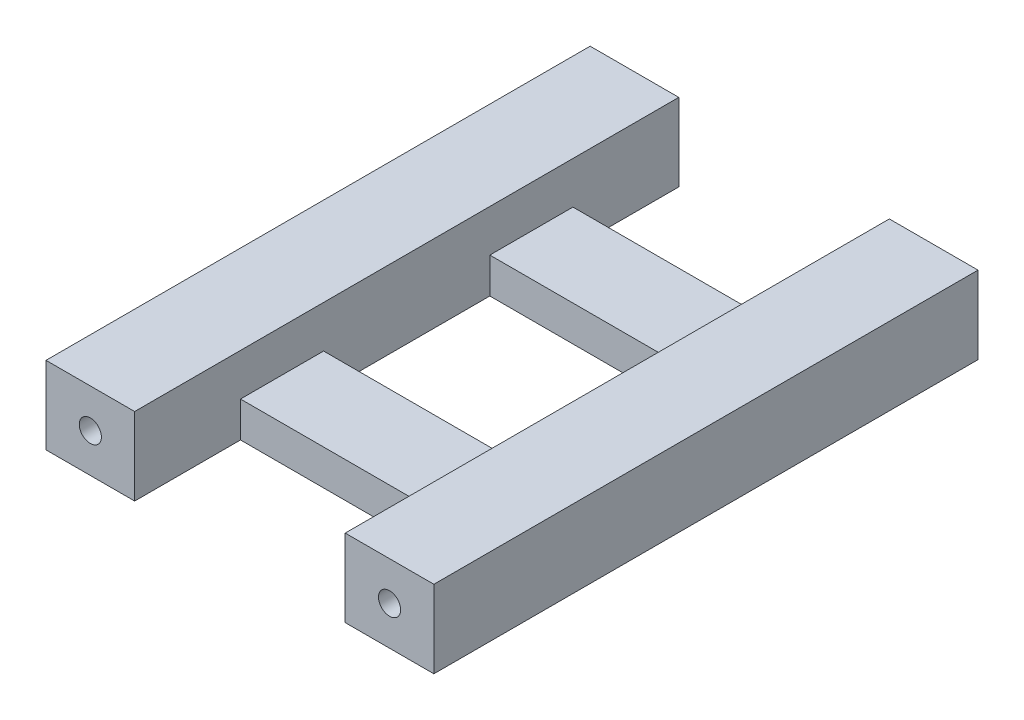
ISO-10303-21;
HEADER;
FILE_DESCRIPTION(('STEP AP214'),'2;1');
FILE_NAME('part.step','',(''),(''),'','','');
FILE_SCHEMA(('AUTOMOTIVE_DESIGN { 1 0 10303 214 1 1 1 1 }'));
ENDSEC;
DATA;
#1=APPLICATION_CONTEXT('core data for automotive mechanical design processes');
#2=APPLICATION_PROTOCOL_DEFINITION('international standard','automotive_design',2000,#1);
#3=PRODUCT_CONTEXT('',#1,'mechanical');
#4=PRODUCT('Part','Part','',(#3));
#5=PRODUCT_RELATED_PRODUCT_CATEGORY('part','',(#4));
#6=PRODUCT_DEFINITION_FORMATION('','',#4);
#7=PRODUCT_DEFINITION_CONTEXT('part definition',#1,'design');
#8=PRODUCT_DEFINITION('design','',#6,#7);
#9=PRODUCT_DEFINITION_SHAPE('','',#8);
#10=(LENGTH_UNIT() NAMED_UNIT(*) SI_UNIT(.MILLI.,.METRE.));
#11=(NAMED_UNIT(*) PLANE_ANGLE_UNIT() SI_UNIT($,.RADIAN.));
#12=(NAMED_UNIT(*) SI_UNIT($,.STERADIAN.) SOLID_ANGLE_UNIT());
#13=UNCERTAINTY_MEASURE_WITH_UNIT(LENGTH_MEASURE(1.E-05),#10,'distance_accuracy_value','');
#14=(GEOMETRIC_REPRESENTATION_CONTEXT(3) GLOBAL_UNCERTAINTY_ASSIGNED_CONTEXT((#13)) GLOBAL_UNIT_ASSIGNED_CONTEXT((#10,
#11,#12)) REPRESENTATION_CONTEXT('',''));
#15=CARTESIAN_POINT('',(0.,0.,0.));
#16=DIRECTION('',(0.,0.,1.));
#17=DIRECTION('',(1.,0.,0.));
#18=AXIS2_PLACEMENT_3D('',#15,#16,#17);
#19=CARTESIAN_POINT('',(0.,7.,0.));
#20=DIRECTION('',(0.,1.,0.));
#21=DIRECTION('',(0.,0.,1.));
#22=AXIS2_PLACEMENT_3D('',#19,#20,#21);
#23=PLANE('',#22);
#24=DIRECTION('',(1.,0.,0.));
#25=VECTOR('',#24,1.);
#26=CARTESIAN_POINT('',(-18.407645754449,7.,24.6634549563666));
#27=LINE('',#26,#25);
#28=CARTESIAN_POINT('',(-18.407645754449,7.,24.6634549563666));
#29=VERTEX_POINT('',#28);
#30=CARTESIAN_POINT('',(-10.407645754449,7.,24.6634549563666));
#31=VERTEX_POINT('',#30);
#32=EDGE_CURVE('E220',#29,#31,#27,.T.);
#33=ORIENTED_EDGE('',*,*,#32,.T.);
#34=DIRECTION('',(0.,0.,-1.));
#35=VECTOR('',#34,1.);
#36=CARTESIAN_POINT('',(-10.407645754449,7.,-14.8865442806934));
#37=LINE('',#36,#35);
#38=CARTESIAN_POINT('',(-10.407645754449,7.,-24.4365435177544));
#39=VERTEX_POINT('',#38);
#40=EDGE_CURVE('E251',#31,#39,#37,.T.);
#41=ORIENTED_EDGE('',*,*,#40,.T.);
#42=DIRECTION('',(-1.,0.,0.));
#43=VECTOR('',#42,1.);
#44=CARTESIAN_POINT('',(-10.407645754449,7.,-24.4365435177544));
#45=LINE('',#44,#43);
#46=CARTESIAN_POINT('',(-18.407645754449,7.,-24.4365435177544));
#47=VERTEX_POINT('',#46);
#48=EDGE_CURVE('E248',#39,#47,#45,.T.);
#49=ORIENTED_EDGE('',*,*,#48,.T.);
#50=DIRECTION('',(0.,0.,1.));
#51=VECTOR('',#50,1.);
#52=CARTESIAN_POINT('',(-18.407645754449,7.,-24.4365435177544));
#53=LINE('',#52,#51);
#54=EDGE_CURVE('E244',#47,#29,#53,.T.);
#55=ORIENTED_EDGE('',*,*,#54,.T.);
#56=EDGE_LOOP('',(#33,#41,#49,#55));
#57=FACE_BOUND('',#56,.T.);
#58=ADVANCED_FACE('F37',(#57),#23,.T.);
#59=DIRECTION('',(0.,0.,1.));
#60=VECTOR('',#59,1.);
#61=CARTESIAN_POINT('',(8.59235424555098,7.,-24.4365435177544));
#62=LINE('',#61,#60);
#63=CARTESIAN_POINT('',(8.59235424555098,7.,-24.4365435177544));
#64=VERTEX_POINT('',#63);
#65=CARTESIAN_POINT('',(8.59235424555098,7.,24.6634549563666));
#66=VERTEX_POINT('',#65);
#67=EDGE_CURVE('E255',#64,#66,#62,.T.);
#68=ORIENTED_EDGE('',*,*,#67,.T.);
#69=DIRECTION('',(1.,0.,0.));
#70=VECTOR('',#69,1.);
#71=CARTESIAN_POINT('',(8.59235424555098,7.,24.6634549563666));
#72=LINE('',#71,#70);
#73=CARTESIAN_POINT('',(16.592354245551,7.,24.6634549563666));
#74=VERTEX_POINT('',#73);
#75=EDGE_CURVE('E242',#66,#74,#72,.T.);
#76=ORIENTED_EDGE('',*,*,#75,.T.);
#77=DIRECTION('',(0.,0.,-1.));
#78=VECTOR('',#77,1.);
#79=CARTESIAN_POINT('',(16.592354245551,7.,24.6634549563666));
#80=LINE('',#79,#78);
#81=CARTESIAN_POINT('',(16.592354245551,7.,-24.4365435177544));
#82=VERTEX_POINT('',#81);
#83=EDGE_CURVE('E203',#74,#82,#80,.T.);
#84=ORIENTED_EDGE('',*,*,#83,.T.);
#85=DIRECTION('',(-1.,0.,0.));
#86=VECTOR('',#85,1.);
#87=CARTESIAN_POINT('',(16.592354245551,7.,-24.4365435177544));
#88=LINE('',#87,#86);
#89=EDGE_CURVE('E257',#82,#64,#88,.T.);
#90=ORIENTED_EDGE('',*,*,#89,.T.);
#91=EDGE_LOOP('',(#68,#76,#84,#90));
#92=FACE_BOUND('',#91,.T.);
#93=ADVANCED_FACE('F304',(#92),#23,.T.);
#94=CARTESIAN_POINT('',(0.,0.,0.));
#95=DIRECTION('',(0.,1.,0.));
#96=DIRECTION('',(0.,0.,1.));
#97=AXIS2_PLACEMENT_3D('',#94,#95,#96);
#98=PLANE('',#97);
#99=DIRECTION('',(1.,0.,0.));
#100=VECTOR('',#99,1.);
#101=CARTESIAN_POINT('',(8.59235424555098,0.,24.6634549563666));
#102=LINE('',#101,#100);
#103=CARTESIAN_POINT('',(8.59235424555098,0.,24.6634549563666));
#104=VERTEX_POINT('',#103);
#105=CARTESIAN_POINT('',(16.592354245551,0.,24.6634549563666));
#106=VERTEX_POINT('',#105);
#107=EDGE_CURVE('E209',#104,#106,#102,.T.);
#108=ORIENTED_EDGE('',*,*,#107,.F.);
#109=DIRECTION('',(0.,0.,1.));
#110=VECTOR('',#109,1.);
#111=CARTESIAN_POINT('',(8.59235424555098,0.,15.1134557193066));
#112=LINE('',#111,#110);
#113=CARTESIAN_POINT('',(8.59235424555098,0.,15.1134557193066));
#114=VERTEX_POINT('',#113);
#115=EDGE_CURVE('E241',#114,#104,#112,.T.);
#116=ORIENTED_EDGE('',*,*,#115,.F.);
#117=DIRECTION('',(1.,0.,0.));
#118=VECTOR('',#117,1.);
#119=CARTESIAN_POINT('',(-10.407645754449,0.,15.1134557193066));
#120=LINE('',#119,#118);
#121=CARTESIAN_POINT('',(-10.407645754449,0.,15.1134557193066));
#122=VERTEX_POINT('',#121);
#123=EDGE_CURVE('E239',#122,#114,#120,.T.);
#124=ORIENTED_EDGE('',*,*,#123,.F.);
#125=DIRECTION('',(0.,0.,-1.));
#126=VECTOR('',#125,1.);
#127=CARTESIAN_POINT('',(-10.407645754449,0.,24.6634549563666));
#128=LINE('',#127,#126);
#129=CARTESIAN_POINT('',(-10.407645754449,0.,24.6634549563666));
#130=VERTEX_POINT('',#129);
#131=EDGE_CURVE('E168',#130,#122,#128,.T.);
#132=ORIENTED_EDGE('',*,*,#131,.F.);
#133=DIRECTION('',(1.,0.,0.));
#134=VECTOR('',#133,1.);
#135=CARTESIAN_POINT('',(-18.407645754449,0.,24.6634549563666));
#136=LINE('',#135,#134);
#137=CARTESIAN_POINT('',(-18.407645754449,0.,24.6634549563666));
#138=VERTEX_POINT('',#137);
#139=EDGE_CURVE('E236',#138,#130,#136,.T.);
#140=ORIENTED_EDGE('',*,*,#139,.F.);
#141=DIRECTION('',(0.,0.,1.));
#142=VECTOR('',#141,1.);
#143=CARTESIAN_POINT('',(-18.407645754449,0.,-24.4365435177544));
#144=LINE('',#143,#142);
#145=CARTESIAN_POINT('',(-18.407645754449,0.,-24.4365435177544));
#146=VERTEX_POINT('',#145);
#147=EDGE_CURVE('E234',#146,#138,#144,.T.);
#148=ORIENTED_EDGE('',*,*,#147,.F.);
#149=DIRECTION('',(-1.,0.,0.));
#150=VECTOR('',#149,1.);
#151=CARTESIAN_POINT('',(-10.407645754449,0.,-24.4365435177544));
#152=LINE('',#151,#150);
#153=CARTESIAN_POINT('',(-10.407645754449,0.,-24.4365435177544));
#154=VERTEX_POINT('',#153);
#155=EDGE_CURVE('E232',#154,#146,#152,.T.);
#156=ORIENTED_EDGE('',*,*,#155,.F.);
#157=DIRECTION('',(0.,0.,-1.));
#158=VECTOR('',#157,1.);
#159=CARTESIAN_POINT('',(-10.407645754449,0.,-14.8865442806934));
#160=LINE('',#159,#158);
#161=CARTESIAN_POINT('',(-10.407645754449,0.,-14.8865442806934));
#162=VERTEX_POINT('',#161);
#163=EDGE_CURVE('E230',#162,#154,#160,.T.);
#164=ORIENTED_EDGE('',*,*,#163,.F.);
#165=DIRECTION('',(-1.,0.,0.));
#166=VECTOR('',#165,1.);
#167=CARTESIAN_POINT('',(8.59235424555098,0.,-14.8865442806934));
#168=LINE('',#167,#166);
#169=CARTESIAN_POINT('',(8.59235424555098,0.,-14.8865442806934));
#170=VERTEX_POINT('',#169);
#171=EDGE_CURVE('E227',#170,#162,#168,.T.);
#172=ORIENTED_EDGE('',*,*,#171,.F.);
#173=DIRECTION('',(0.,0.,1.));
#174=VECTOR('',#173,1.);
#175=CARTESIAN_POINT('',(8.59235424555098,0.,-24.4365435177544));
#176=LINE('',#175,#174);
#177=CARTESIAN_POINT('',(8.59235424555098,0.,-24.4365435177544));
#178=VERTEX_POINT('',#177);
#179=EDGE_CURVE('E224',#178,#170,#176,.T.);
#180=ORIENTED_EDGE('',*,*,#179,.F.);
#181=DIRECTION('',(-1.,0.,0.));
#182=VECTOR('',#181,1.);
#183=CARTESIAN_POINT('',(16.592354245551,0.,-24.4365435177544));
#184=LINE('',#183,#182);
#185=CARTESIAN_POINT('',(16.592354245551,0.,-24.4365435177544));
#186=VERTEX_POINT('',#185);
#187=EDGE_CURVE('E215',#186,#178,#184,.T.);
#188=ORIENTED_EDGE('',*,*,#187,.F.);
#189=DIRECTION('',(0.,0.,-1.));
#190=VECTOR('',#189,1.);
#191=CARTESIAN_POINT('',(16.592354245551,0.,24.6634549563666));
#192=LINE('',#191,#190);
#193=EDGE_CURVE('E202',#106,#186,#192,.T.);
#194=ORIENTED_EDGE('',*,*,#193,.F.);
#195=EDGE_LOOP('',(#108,#116,#124,#132,#140,#148,#156,#164,#172,#180,#188,#194));
#196=FACE_BOUND('',#195,.T.);
#197=DIRECTION('',(0.,0.,1.));
#198=VECTOR('',#197,1.);
#199=CARTESIAN_POINT('',(-10.407645754449,0.,-7.38654428069337));
#200=LINE('',#199,#198);
#201=CARTESIAN_POINT('',(-10.407645754449,0.,-7.38654428069337));
#202=VERTEX_POINT('',#201);
#203=CARTESIAN_POINT('',(-10.407645754449,0.,7.61345571930663));
#204=VERTEX_POINT('',#203);
#205=EDGE_CURVE('E275',#202,#204,#200,.T.);
#206=ORIENTED_EDGE('',*,*,#205,.T.);
#207=DIRECTION('',(1.,0.,0.));
#208=VECTOR('',#207,1.);
#209=CARTESIAN_POINT('',(-10.407645754449,0.,7.61345571930663));
#210=LINE('',#209,#208);
#211=CARTESIAN_POINT('',(8.59235424555098,0.,7.61345571930663));
#212=VERTEX_POINT('',#211);
#213=EDGE_CURVE('E272',#204,#212,#210,.T.);
#214=ORIENTED_EDGE('',*,*,#213,.T.);
#215=DIRECTION('',(0.,0.,-1.));
#216=VECTOR('',#215,1.);
#217=CARTESIAN_POINT('',(8.59235424555098,0.,-7.38654428069337));
#218=LINE('',#217,#216);
#219=CARTESIAN_POINT('',(8.59235424555098,0.,-7.38654428069337));
#220=VERTEX_POINT('',#219);
#221=EDGE_CURVE('E269',#212,#220,#218,.T.);
#222=ORIENTED_EDGE('',*,*,#221,.T.);
#223=DIRECTION('',(-1.,0.,0.));
#224=VECTOR('',#223,1.);
#225=CARTESIAN_POINT('',(-10.407645754449,0.,-7.38654428069337));
#226=LINE('',#225,#224);
#227=EDGE_CURVE('E266',#220,#202,#226,.T.);
#228=ORIENTED_EDGE('',*,*,#227,.T.);
#229=EDGE_LOOP('',(#206,#214,#222,#228));
#230=FACE_BOUND('',#229,.T.);
#231=ADVANCED_FACE('F298',(#196,#230),#98,.F.);
#232=CARTESIAN_POINT('',(8.59235424555098,7.,24.6634549563666));
#233=DIRECTION('',(0.,0.,-1.));
#234=DIRECTION('',(-1.,0.,0.));
#235=AXIS2_PLACEMENT_3D('',#232,#233,#234);
#236=PLANE('',#235);
#237=CARTESIAN_POINT('',(12.592354245551,3.5,24.6634549563666));
#238=DIRECTION('',(0.,0.,1.));
#239=DIRECTION('',(1.,0.,0.));
#240=AXIS2_PLACEMENT_3D('',#237,#238,#239);
#241=CIRCLE('',#240,1.);
#242=CARTESIAN_POINT('',(13.592354245551,3.5,24.6634549563666));
#243=VERTEX_POINT('',#242);
#244=EDGE_CURVE('E287',#243,#243,#241,.T.);
#245=ORIENTED_EDGE('',*,*,#244,.F.);
#246=EDGE_LOOP('',(#245));
#247=FACE_BOUND('',#246,.T.);
#248=ORIENTED_EDGE('',*,*,#107,.T.);
#249=DIRECTION('',(0.,-1.,0.));
#250=VECTOR('',#249,1.);
#251=CARTESIAN_POINT('',(16.592354245551,7.,24.6634549563666));
#252=LINE('',#251,#250);
#253=EDGE_CURVE('E46',#74,#106,#252,.T.);
#254=ORIENTED_EDGE('',*,*,#253,.F.);
#255=ORIENTED_EDGE('',*,*,#75,.F.);
#256=DIRECTION('',(0.,-1.,0.));
#257=VECTOR('',#256,1.);
#258=CARTESIAN_POINT('',(8.59235424555098,7.,24.6634549563666));
#259=LINE('',#258,#257);
#260=EDGE_CURVE('E174',#66,#104,#259,.T.);
#261=ORIENTED_EDGE('',*,*,#260,.T.);
#262=EDGE_LOOP('',(#248,#254,#255,#261));
#263=FACE_BOUND('',#262,.T.);
#264=ADVANCED_FACE('F39',(#247,#263),#236,.F.);
#265=CARTESIAN_POINT('',(16.592354245551,7.,24.6634549563666));
#266=DIRECTION('',(-1.,0.,0.));
#267=DIRECTION('',(0.,0.,1.));
#268=AXIS2_PLACEMENT_3D('',#265,#266,#267);
#269=PLANE('',#268);
#270=ORIENTED_EDGE('',*,*,#193,.T.);
#271=DIRECTION('',(0.,-1.,0.));
#272=VECTOR('',#271,1.);
#273=CARTESIAN_POINT('',(16.592354245551,7.,-24.4365435177544));
#274=LINE('',#273,#272);
#275=EDGE_CURVE('E193',#82,#186,#274,.T.);
#276=ORIENTED_EDGE('',*,*,#275,.F.);
#277=ORIENTED_EDGE('',*,*,#83,.F.);
#278=ORIENTED_EDGE('',*,*,#253,.T.);
#279=EDGE_LOOP('',(#270,#276,#277,#278));
#280=FACE_BOUND('',#279,.T.);
#281=ADVANCED_FACE('F200',(#280),#269,.F.);
#282=CARTESIAN_POINT('',(16.592354245551,7.,-24.4365435177544));
#283=DIRECTION('',(0.,0.,1.));
#284=DIRECTION('',(1.,0.,0.));
#285=AXIS2_PLACEMENT_3D('',#282,#283,#284);
#286=PLANE('',#285);
#287=CARTESIAN_POINT('',(12.592354245551,3.5,-24.4365435177544));
#288=DIRECTION('',(0.,0.,1.));
#289=DIRECTION('',(1.,0.,0.));
#290=AXIS2_PLACEMENT_3D('',#287,#288,#289);
#291=CIRCLE('',#290,1.);
#292=CARTESIAN_POINT('',(13.592354245551,3.5,-24.4365435177544));
#293=VERTEX_POINT('',#292);
#294=EDGE_CURVE('E41',#293,#293,#291,.T.);
#295=ORIENTED_EDGE('',*,*,#294,.T.);
#296=EDGE_LOOP('',(#295));
#297=FACE_BOUND('',#296,.T.);
#298=ORIENTED_EDGE('',*,*,#187,.T.);
#299=DIRECTION('',(0.,-1.,0.));
#300=VECTOR('',#299,1.);
#301=CARTESIAN_POINT('',(8.59235424555098,7.,-24.4365435177544));
#302=LINE('',#301,#300);
#303=EDGE_CURVE('E190',#64,#178,#302,.T.);
#304=ORIENTED_EDGE('',*,*,#303,.F.);
#305=ORIENTED_EDGE('',*,*,#89,.F.);
#306=ORIENTED_EDGE('',*,*,#275,.T.);
#307=EDGE_LOOP('',(#298,#304,#305,#306));
#308=FACE_BOUND('',#307,.T.);
#309=ADVANCED_FACE('F303',(#297,#308),#286,.F.);
#310=CARTESIAN_POINT('',(8.59235424555098,7.,-14.8865442806934));
#311=DIRECTION('',(0.,0.,1.));
#312=DIRECTION('',(1.,0.,0.));
#313=AXIS2_PLACEMENT_3D('',#310,#311,#312);
#314=PLANE('',#313);
#315=DIRECTION('',(0.,-1.,0.));
#316=VECTOR('',#315,1.);
#317=CARTESIAN_POINT('',(-10.407645754449,7.,-14.8865442806934));
#318=LINE('',#317,#316);
#319=CARTESIAN_POINT('',(-10.407645754449,3.2,-14.8865442806934));
#320=VERTEX_POINT('',#319);
#321=EDGE_CURVE('E186',#320,#162,#318,.T.);
#322=ORIENTED_EDGE('',*,*,#321,.F.);
#323=DIRECTION('',(1.,0.,0.));
#324=VECTOR('',#323,1.);
#325=CARTESIAN_POINT('',(8.59235424555098,3.2,-14.8865442806934));
#326=LINE('',#325,#324);
#327=CARTESIAN_POINT('',(8.59235424555098,3.2,-14.8865442806934));
#328=VERTEX_POINT('',#327);
#329=EDGE_CURVE('E278',#320,#328,#326,.T.);
#330=ORIENTED_EDGE('',*,*,#329,.T.);
#331=DIRECTION('',(0.,-1.,0.));
#332=VECTOR('',#331,1.);
#333=CARTESIAN_POINT('',(8.59235424555098,7.,-14.8865442806934));
#334=LINE('',#333,#332);
#335=EDGE_CURVE('E188',#328,#170,#334,.T.);
#336=ORIENTED_EDGE('',*,*,#335,.T.);
#337=ORIENTED_EDGE('',*,*,#171,.T.);
#338=EDGE_LOOP('',(#322,#330,#336,#337));
#339=FACE_BOUND('',#338,.T.);
#340=ADVANCED_FACE('F335',(#339),#314,.F.);
#341=CARTESIAN_POINT('',(-10.407645754449,7.,-24.4365435177544));
#342=DIRECTION('',(0.,0.,1.));
#343=DIRECTION('',(1.,0.,0.));
#344=AXIS2_PLACEMENT_3D('',#341,#342,#343);
#345=PLANE('',#344);
#346=CARTESIAN_POINT('',(-14.407645754449,3.5,-24.4365435177544));
#347=DIRECTION('',(0.,0.,1.));
#348=DIRECTION('',(1.,0.,0.));
#349=AXIS2_PLACEMENT_3D('',#346,#347,#348);
#350=CIRCLE('',#349,1.);
#351=CARTESIAN_POINT('',(-13.407645754449,3.5,-24.4365435177544));
#352=VERTEX_POINT('',#351);
#353=EDGE_CURVE('E284',#352,#352,#350,.T.);
#354=ORIENTED_EDGE('',*,*,#353,.T.);
#355=EDGE_LOOP('',(#354));
#356=FACE_BOUND('',#355,.T.);
#357=ORIENTED_EDGE('',*,*,#155,.T.);
#358=DIRECTION('',(0.,-1.,0.));
#359=VECTOR('',#358,1.);
#360=CARTESIAN_POINT('',(-18.407645754449,7.,-24.4365435177544));
#361=LINE('',#360,#359);
#362=EDGE_CURVE('E180',#47,#146,#361,.T.);
#363=ORIENTED_EDGE('',*,*,#362,.F.);
#364=ORIENTED_EDGE('',*,*,#48,.F.);
#365=DIRECTION('',(0.,-1.,0.));
#366=VECTOR('',#365,1.);
#367=CARTESIAN_POINT('',(-10.407645754449,7.,-24.4365435177544));
#368=LINE('',#367,#366);
#369=EDGE_CURVE('E183',#39,#154,#368,.T.);
#370=ORIENTED_EDGE('',*,*,#369,.T.);
#371=EDGE_LOOP('',(#357,#363,#364,#370));
#372=FACE_BOUND('',#371,.T.);
#373=ADVANCED_FACE('F331',(#356,#372),#345,.F.);
#374=CARTESIAN_POINT('',(-18.407645754449,7.,-24.4365435177544));
#375=DIRECTION('',(1.,0.,0.));
#376=DIRECTION('',(0.,0.,-1.));
#377=AXIS2_PLACEMENT_3D('',#374,#375,#376);
#378=PLANE('',#377);
#379=ORIENTED_EDGE('',*,*,#147,.T.);
#380=DIRECTION('',(0.,-1.,0.));
#381=VECTOR('',#380,1.);
#382=CARTESIAN_POINT('',(-18.407645754449,7.,24.6634549563666));
#383=LINE('',#382,#381);
#384=EDGE_CURVE('E172',#29,#138,#383,.T.);
#385=ORIENTED_EDGE('',*,*,#384,.F.);
#386=ORIENTED_EDGE('',*,*,#54,.F.);
#387=ORIENTED_EDGE('',*,*,#362,.T.);
#388=EDGE_LOOP('',(#379,#385,#386,#387));
#389=FACE_BOUND('',#388,.T.);
#390=ADVANCED_FACE('F327',(#389),#378,.F.);
#391=CARTESIAN_POINT('',(-18.407645754449,7.,24.6634549563666));
#392=DIRECTION('',(0.,0.,-1.));
#393=DIRECTION('',(-1.,0.,0.));
#394=AXIS2_PLACEMENT_3D('',#391,#392,#393);
#395=PLANE('',#394);
#396=CARTESIAN_POINT('',(-14.407645754449,3.5,24.6634549563666));
#397=DIRECTION('',(0.,0.,1.));
#398=DIRECTION('',(1.,0.,0.));
#399=AXIS2_PLACEMENT_3D('',#396,#397,#398);
#400=CIRCLE('',#399,1.);
#401=CARTESIAN_POINT('',(-13.407645754449,3.5,24.6634549563666));
#402=VERTEX_POINT('',#401);
#403=EDGE_CURVE('E288',#402,#402,#400,.T.);
#404=ORIENTED_EDGE('',*,*,#403,.F.);
#405=EDGE_LOOP('',(#404));
#406=FACE_BOUND('',#405,.T.);
#407=ORIENTED_EDGE('',*,*,#139,.T.);
#408=DIRECTION('',(0.,-1.,0.));
#409=VECTOR('',#408,1.);
#410=CARTESIAN_POINT('',(-10.407645754449,7.,24.6634549563666));
#411=LINE('',#410,#409);
#412=EDGE_CURVE('E170',#31,#130,#411,.T.);
#413=ORIENTED_EDGE('',*,*,#412,.F.);
#414=ORIENTED_EDGE('',*,*,#32,.F.);
#415=ORIENTED_EDGE('',*,*,#384,.T.);
#416=EDGE_LOOP('',(#407,#413,#414,#415));
#417=FACE_BOUND('',#416,.T.);
#418=ADVANCED_FACE('F324',(#406,#417),#395,.F.);
#419=CARTESIAN_POINT('',(-10.407645754449,7.,24.6634549563666));
#420=DIRECTION('',(-1.,0.,0.));
#421=DIRECTION('',(0.,0.,1.));
#422=AXIS2_PLACEMENT_3D('',#419,#420,#421);
#423=PLANE('',#422);
#424=ORIENTED_EDGE('',*,*,#131,.T.);
#425=DIRECTION('',(0.,-1.,0.));
#426=VECTOR('',#425,1.);
#427=CARTESIAN_POINT('',(-10.407645754449,7.,15.1134557193066));
#428=LINE('',#427,#426);
#429=CARTESIAN_POINT('',(-10.407645754449,3.2,15.1134557193066));
#430=VERTEX_POINT('',#429);
#431=EDGE_CURVE('E161',#430,#122,#428,.T.);
#432=ORIENTED_EDGE('',*,*,#431,.F.);
#433=DIRECTION('',(0.,0.,1.));
#434=VECTOR('',#433,1.);
#435=CARTESIAN_POINT('',(-10.407645754449,3.2,-22.7865442806934));
#436=LINE('',#435,#434);
#437=CARTESIAN_POINT('',(-10.407645754449,3.2,7.61345571930663));
#438=VERTEX_POINT('',#437);
#439=EDGE_CURVE('E148',#438,#430,#436,.T.);
#440=ORIENTED_EDGE('',*,*,#439,.F.);
#441=DIRECTION('',(0.,-1.,0.));
#442=VECTOR('',#441,1.);
#443=CARTESIAN_POINT('',(-10.407645754449,7.,7.61345571930663));
#444=LINE('',#443,#442);
#445=EDGE_CURVE('E213',#438,#204,#444,.T.);
#446=ORIENTED_EDGE('',*,*,#445,.T.);
#447=ORIENTED_EDGE('',*,*,#205,.F.);
#448=DIRECTION('',(0.,-1.,0.));
#449=VECTOR('',#448,1.);
#450=CARTESIAN_POINT('',(-10.407645754449,7.,-7.38654428069337));
#451=LINE('',#450,#449);
#452=CARTESIAN_POINT('',(-10.407645754449,3.2,-7.38654428069337));
#453=VERTEX_POINT('',#452);
#454=EDGE_CURVE('E264',#453,#202,#451,.T.);
#455=ORIENTED_EDGE('',*,*,#454,.F.);
#456=EDGE_CURVE('E60',#320,#453,#436,.T.);
#457=ORIENTED_EDGE('',*,*,#456,.F.);
#458=ORIENTED_EDGE('',*,*,#321,.T.);
#459=ORIENTED_EDGE('',*,*,#163,.T.);
#460=ORIENTED_EDGE('',*,*,#369,.F.);
#461=ORIENTED_EDGE('',*,*,#40,.F.);
#462=ORIENTED_EDGE('',*,*,#412,.T.);
#463=EDGE_LOOP('',(#424,#432,#440,#446,#447,#455,#457,#458,#459,#460,#461,#462));
#464=FACE_BOUND('',#463,.T.);
#465=ADVANCED_FACE('F165',(#464),#423,.F.);
#466=CARTESIAN_POINT('',(-10.407645754449,7.,15.1134557193066));
#467=DIRECTION('',(0.,0.,-1.));
#468=DIRECTION('',(-1.,0.,0.));
#469=AXIS2_PLACEMENT_3D('',#466,#467,#468);
#470=PLANE('',#469);
#471=DIRECTION('',(0.,-1.,0.));
#472=VECTOR('',#471,1.);
#473=CARTESIAN_POINT('',(8.59235424555098,7.,15.1134557193066));
#474=LINE('',#473,#472);
#475=CARTESIAN_POINT('',(8.59235424555098,3.2,15.1134557193066));
#476=VERTEX_POINT('',#475);
#477=EDGE_CURVE('E163',#476,#114,#474,.T.);
#478=ORIENTED_EDGE('',*,*,#477,.F.);
#479=DIRECTION('',(1.,0.,0.));
#480=VECTOR('',#479,1.);
#481=CARTESIAN_POINT('',(-10.407645754449,3.2,15.1134557193066));
#482=LINE('',#481,#480);
#483=EDGE_CURVE('E151',#430,#476,#482,.T.);
#484=ORIENTED_EDGE('',*,*,#483,.F.);
#485=ORIENTED_EDGE('',*,*,#431,.T.);
#486=ORIENTED_EDGE('',*,*,#123,.T.);
#487=EDGE_LOOP('',(#478,#484,#485,#486));
#488=FACE_BOUND('',#487,.T.);
#489=ADVANCED_FACE('F159',(#488),#470,.F.);
#490=CARTESIAN_POINT('',(8.59235424555098,7.,15.1134557193066));
#491=DIRECTION('',(1.,0.,0.));
#492=DIRECTION('',(0.,0.,-1.));
#493=AXIS2_PLACEMENT_3D('',#490,#491,#492);
#494=PLANE('',#493);
#495=ORIENTED_EDGE('',*,*,#115,.T.);
#496=ORIENTED_EDGE('',*,*,#260,.F.);
#497=ORIENTED_EDGE('',*,*,#67,.F.);
#498=ORIENTED_EDGE('',*,*,#303,.T.);
#499=ORIENTED_EDGE('',*,*,#179,.T.);
#500=ORIENTED_EDGE('',*,*,#335,.F.);
#501=DIRECTION('',(0.,0.,1.));
#502=VECTOR('',#501,1.);
#503=CARTESIAN_POINT('',(8.59235424555098,3.2,-22.7865442806934));
#504=LINE('',#503,#502);
#505=CARTESIAN_POINT('',(8.59235424555098,3.2,-7.38654428069337));
#506=VERTEX_POINT('',#505);
#507=EDGE_CURVE('E281',#328,#506,#504,.T.);
#508=ORIENTED_EDGE('',*,*,#507,.T.);
#509=DIRECTION('',(0.,-1.,0.));
#510=VECTOR('',#509,1.);
#511=CARTESIAN_POINT('',(8.59235424555098,7.,-7.38654428069337));
#512=LINE('',#511,#510);
#513=EDGE_CURVE('E262',#506,#220,#512,.T.);
#514=ORIENTED_EDGE('',*,*,#513,.T.);
#515=ORIENTED_EDGE('',*,*,#221,.F.);
#516=DIRECTION('',(0.,-1.,0.));
#517=VECTOR('',#516,1.);
#518=CARTESIAN_POINT('',(8.59235424555098,7.,7.61345571930663));
#519=LINE('',#518,#517);
#520=CARTESIAN_POINT('',(8.59235424555098,3.2,7.61345571930663));
#521=VERTEX_POINT('',#520);
#522=EDGE_CURVE('E217',#521,#212,#519,.T.);
#523=ORIENTED_EDGE('',*,*,#522,.F.);
#524=EDGE_CURVE('E53',#521,#476,#504,.T.);
#525=ORIENTED_EDGE('',*,*,#524,.T.);
#526=ORIENTED_EDGE('',*,*,#477,.T.);
#527=EDGE_LOOP('',(#495,#496,#497,#498,#499,#500,#508,#514,#515,#523,#525,#526));
#528=FACE_BOUND('',#527,.T.);
#529=ADVANCED_FACE('F316',(#528),#494,.F.);
#530=CARTESIAN_POINT('',(-10.407645754449,7.,7.61345571930663));
#531=DIRECTION('',(0.,0.,-1.));
#532=DIRECTION('',(-1.,0.,0.));
#533=AXIS2_PLACEMENT_3D('',#530,#531,#532);
#534=PLANE('',#533);
#535=DIRECTION('',(-1.,0.,0.));
#536=VECTOR('',#535,1.);
#537=CARTESIAN_POINT('',(-10.407645754449,3.2,7.61345571930663));
#538=LINE('',#537,#536);
#539=EDGE_CURVE('E153',#521,#438,#538,.T.);
#540=ORIENTED_EDGE('',*,*,#539,.F.);
#541=ORIENTED_EDGE('',*,*,#522,.T.);
#542=ORIENTED_EDGE('',*,*,#213,.F.);
#543=ORIENTED_EDGE('',*,*,#445,.F.);
#544=EDGE_LOOP('',(#540,#541,#542,#543));
#545=FACE_BOUND('',#544,.T.);
#546=ADVANCED_FACE('F313',(#545),#534,.T.);
#547=CARTESIAN_POINT('',(-10.407645754449,7.,-7.38654428069337));
#548=DIRECTION('',(0.,0.,1.));
#549=DIRECTION('',(1.,0.,0.));
#550=AXIS2_PLACEMENT_3D('',#547,#548,#549);
#551=PLANE('',#550);
#552=DIRECTION('',(1.,0.,0.));
#553=VECTOR('',#552,1.);
#554=CARTESIAN_POINT('',(-10.407645754449,3.2,-7.38654428069337));
#555=LINE('',#554,#553);
#556=EDGE_CURVE('E11',#453,#506,#555,.T.);
#557=ORIENTED_EDGE('',*,*,#556,.F.);
#558=ORIENTED_EDGE('',*,*,#454,.T.);
#559=ORIENTED_EDGE('',*,*,#227,.F.);
#560=ORIENTED_EDGE('',*,*,#513,.F.);
#561=EDGE_LOOP('',(#557,#558,#559,#560));
#562=FACE_BOUND('',#561,.T.);
#563=ADVANCED_FACE('F363',(#562),#551,.T.);
#564=CARTESIAN_POINT('',(-10.407645754449,3.2,-22.7865442806934));
#565=DIRECTION('',(0.,-1.,0.));
#566=DIRECTION('',(0.,0.,-1.));
#567=AXIS2_PLACEMENT_3D('',#564,#565,#566);
#568=PLANE('',#567);
#569=ORIENTED_EDGE('',*,*,#456,.T.);
#570=ORIENTED_EDGE('',*,*,#556,.T.);
#571=ORIENTED_EDGE('',*,*,#507,.F.);
#572=ORIENTED_EDGE('',*,*,#329,.F.);
#573=EDGE_LOOP('',(#569,#570,#571,#572));
#574=FACE_BOUND('',#573,.T.);
#575=ADVANCED_FACE('F380',(#574),#568,.F.);
#576=ORIENTED_EDGE('',*,*,#539,.T.);
#577=ORIENTED_EDGE('',*,*,#439,.T.);
#578=ORIENTED_EDGE('',*,*,#483,.T.);
#579=ORIENTED_EDGE('',*,*,#524,.F.);
#580=EDGE_LOOP('',(#576,#577,#578,#579));
#581=FACE_BOUND('',#580,.T.);
#582=ADVANCED_FACE('F150',(#581),#568,.F.);
#583=CARTESIAN_POINT('',(-14.407645754449,3.5,-27.2365450436334));
#584=DIRECTION('',(0.,0.,1.));
#585=DIRECTION('',(1.,0.,0.));
#586=AXIS2_PLACEMENT_3D('',#583,#584,#585);
#587=CYLINDRICAL_SURFACE('',#586,1.);
#588=ORIENTED_EDGE('',*,*,#403,.T.);
#589=EDGE_LOOP('',(#588));
#590=FACE_BOUND('',#589,.T.);
#591=ORIENTED_EDGE('',*,*,#353,.F.);
#592=EDGE_LOOP('',(#591));
#593=FACE_BOUND('',#592,.T.);
#594=ADVANCED_FACE('F386',(#590,#593),#587,.F.);
#595=CARTESIAN_POINT('',(12.592354245551,3.5,-27.2365450436334));
#596=DIRECTION('',(0.,0.,1.));
#597=DIRECTION('',(1.,0.,0.));
#598=AXIS2_PLACEMENT_3D('',#595,#596,#597);
#599=CYLINDRICAL_SURFACE('',#598,1.);
#600=ORIENTED_EDGE('',*,*,#244,.T.);
#601=EDGE_LOOP('',(#600));
#602=FACE_BOUND('',#601,.T.);
#603=ORIENTED_EDGE('',*,*,#294,.F.);
#604=EDGE_LOOP('',(#603));
#605=FACE_BOUND('',#604,.T.);
#606=ADVANCED_FACE('F294',(#602,#605),#599,.F.);
#607=CLOSED_SHELL('',(#58,#93,#231,#264,#281,#309,#340,#373,#390,#418,#465,#489,#529,#546,#563,
#575,#582,#594,#606));
#608=MANIFOLD_SOLID_BREP('B2',#607);
#609=ADVANCED_BREP_SHAPE_REPRESENTATION('',(#18,#608),#14);
#610=SHAPE_DEFINITION_REPRESENTATION(#9,#609);
ENDSEC;
END-ISO-10303-21;
